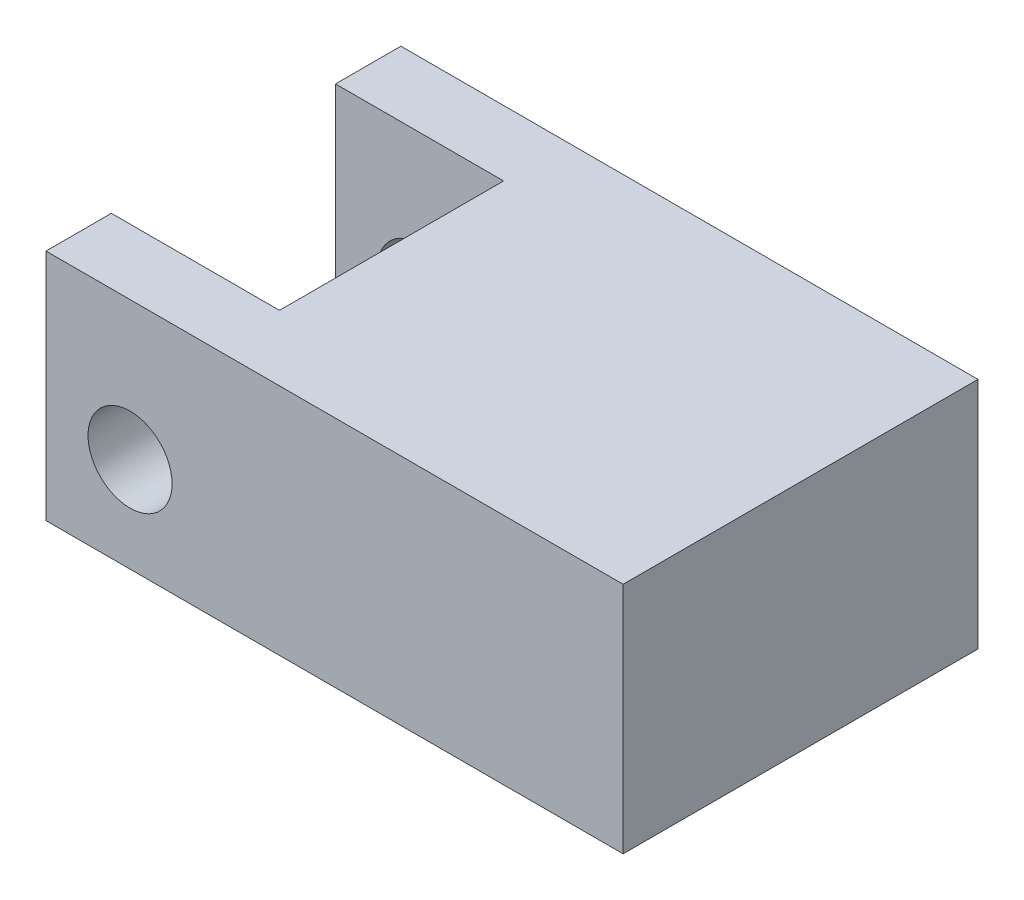
ISO-10303-21;
HEADER;
FILE_DESCRIPTION(('STEP AP214'),'2;1');
FILE_NAME('part.step','',(''),(''),'','','');
FILE_SCHEMA(('AUTOMOTIVE_DESIGN { 1 0 10303 214 1 1 1 1 }'));
ENDSEC;
DATA;
#1=APPLICATION_CONTEXT('core data for automotive mechanical design processes');
#2=APPLICATION_PROTOCOL_DEFINITION('international standard','automotive_design',2000,#1);
#3=PRODUCT_CONTEXT('',#1,'mechanical');
#4=PRODUCT('Part','Part','',(#3));
#5=PRODUCT_RELATED_PRODUCT_CATEGORY('part','',(#4));
#6=PRODUCT_DEFINITION_FORMATION('','',#4);
#7=PRODUCT_DEFINITION_CONTEXT('part definition',#1,'design');
#8=PRODUCT_DEFINITION('design','',#6,#7);
#9=PRODUCT_DEFINITION_SHAPE('','',#8);
#10=(LENGTH_UNIT() NAMED_UNIT(*) SI_UNIT(.MILLI.,.METRE.));
#11=(NAMED_UNIT(*) PLANE_ANGLE_UNIT() SI_UNIT($,.RADIAN.));
#12=(NAMED_UNIT(*) SI_UNIT($,.STERADIAN.) SOLID_ANGLE_UNIT());
#13=UNCERTAINTY_MEASURE_WITH_UNIT(LENGTH_MEASURE(1.E-05),#10,'distance_accuracy_value','');
#14=(GEOMETRIC_REPRESENTATION_CONTEXT(3) GLOBAL_UNCERTAINTY_ASSIGNED_CONTEXT((#13)) GLOBAL_UNIT_ASSIGNED_CONTEXT((#10,
#11,#12)) REPRESENTATION_CONTEXT('',''));
#15=CARTESIAN_POINT('',(0.,0.,0.));
#16=DIRECTION('',(0.,0.,1.));
#17=DIRECTION('',(1.,0.,0.));
#18=AXIS2_PLACEMENT_3D('',#15,#16,#17);
#19=CARTESIAN_POINT('',(-15.45,6.25,9.499999986));
#20=DIRECTION('',(1.,0.,0.));
#21=DIRECTION('',(0.,1.,0.));
#22=AXIS2_PLACEMENT_3D('',#19,#20,#21);
#23=PLANE('',#22);
#24=DIRECTION('',(0.,0.,-1.));
#25=VECTOR('',#24,1.);
#26=CARTESIAN_POINT('',(-15.45,-6.25,9.499999986));
#27=LINE('',#26,#25);
#28=CARTESIAN_POINT('',(-15.45,-6.25,-6.));
#29=VERTEX_POINT('',#28);
#30=CARTESIAN_POINT('',(-15.45,-6.25,-9.499999986));
#31=VERTEX_POINT('',#30);
#32=EDGE_CURVE('E137',#29,#31,#27,.T.);
#33=ORIENTED_EDGE('',*,*,#32,.F.);
#34=DIRECTION('',(0.,1.,0.));
#35=VECTOR('',#34,1.);
#36=CARTESIAN_POINT('',(-15.45,-21.25,-6.));
#37=LINE('',#36,#35);
#38=CARTESIAN_POINT('',(-15.45,6.25,-6.));
#39=VERTEX_POINT('',#38);
#40=EDGE_CURVE('E160',#29,#39,#37,.T.);
#41=ORIENTED_EDGE('',*,*,#40,.T.);
#42=DIRECTION('',(0.,0.,-1.));
#43=VECTOR('',#42,1.);
#44=CARTESIAN_POINT('',(-15.45,6.25,9.499999986));
#45=LINE('',#44,#43);
#46=CARTESIAN_POINT('',(-15.45,6.25,-9.499999986));
#47=VERTEX_POINT('',#46);
#48=EDGE_CURVE('E132',#39,#47,#45,.T.);
#49=ORIENTED_EDGE('',*,*,#48,.T.);
#50=DIRECTION('',(0.,-1.,0.));
#51=VECTOR('',#50,1.);
#52=CARTESIAN_POINT('',(-15.45,6.25,-9.499999986));
#53=LINE('',#52,#51);
#54=EDGE_CURVE('E142',#47,#31,#53,.T.);
#55=ORIENTED_EDGE('',*,*,#54,.T.);
#56=EDGE_LOOP('',(#33,#41,#49,#55));
#57=FACE_BOUND('',#56,.T.);
#58=ADVANCED_FACE('F37',(#57),#23,.F.);
#59=CARTESIAN_POINT('',(15.45,6.25,9.499999986));
#60=DIRECTION('',(-1.,0.,0.));
#61=DIRECTION('',(0.,-1.,0.));
#62=AXIS2_PLACEMENT_3D('',#59,#60,#61);
#63=PLANE('',#62);
#64=DIRECTION('',(0.,1.,0.));
#65=VECTOR('',#64,1.);
#66=CARTESIAN_POINT('',(15.45,6.25,-9.499999986));
#67=LINE('',#66,#65);
#68=CARTESIAN_POINT('',(15.45,-6.25,-9.499999986));
#69=VERTEX_POINT('',#68);
#70=CARTESIAN_POINT('',(15.45,6.25,-9.499999986));
#71=VERTEX_POINT('',#70);
#72=EDGE_CURVE('E148',#69,#71,#67,.T.);
#73=ORIENTED_EDGE('',*,*,#72,.T.);
#74=DIRECTION('',(0.,0.,-1.));
#75=VECTOR('',#74,1.);
#76=CARTESIAN_POINT('',(15.45,6.25,9.499999986));
#77=LINE('',#76,#75);
#78=CARTESIAN_POINT('',(15.45,6.25,9.499999986));
#79=VERTEX_POINT('',#78);
#80=EDGE_CURVE('E11',#79,#71,#77,.T.);
#81=ORIENTED_EDGE('',*,*,#80,.F.);
#82=DIRECTION('',(0.,1.,0.));
#83=VECTOR('',#82,1.);
#84=CARTESIAN_POINT('',(15.45,6.25,9.499999986));
#85=LINE('',#84,#83);
#86=CARTESIAN_POINT('',(15.45,-6.25,9.499999986));
#87=VERTEX_POINT('',#86);
#88=EDGE_CURVE('E141',#87,#79,#85,.T.);
#89=ORIENTED_EDGE('',*,*,#88,.F.);
#90=DIRECTION('',(0.,0.,-1.));
#91=VECTOR('',#90,1.);
#92=CARTESIAN_POINT('',(15.45,-6.25,9.499999986));
#93=LINE('',#92,#91);
#94=EDGE_CURVE('E138',#87,#69,#93,.T.);
#95=ORIENTED_EDGE('',*,*,#94,.T.);
#96=EDGE_LOOP('',(#73,#81,#89,#95));
#97=FACE_BOUND('',#96,.T.);
#98=ADVANCED_FACE('F39',(#97),#63,.F.);
#99=CARTESIAN_POINT('',(-15.45,6.25,9.499999986));
#100=DIRECTION('',(0.,-1.,0.));
#101=DIRECTION('',(0.,0.,-1.));
#102=AXIS2_PLACEMENT_3D('',#99,#100,#101);
#103=PLANE('',#102);
#104=ORIENTED_EDGE('',*,*,#48,.F.);
#105=DIRECTION('',(-1.,0.,0.));
#106=VECTOR('',#105,1.);
#107=CARTESIAN_POINT('',(-15.45,6.25,-6.));
#108=LINE('',#107,#106);
#109=CARTESIAN_POINT('',(-6.45,6.25,-6.));
#110=VERTEX_POINT('',#109);
#111=EDGE_CURVE('E120',#110,#39,#108,.T.);
#112=ORIENTED_EDGE('',*,*,#111,.F.);
#113=DIRECTION('',(0.,0.,-1.));
#114=VECTOR('',#113,1.);
#115=CARTESIAN_POINT('',(-6.45,6.25,-6.));
#116=LINE('',#115,#114);
#117=CARTESIAN_POINT('',(-6.45,6.25,6.));
#118=VERTEX_POINT('',#117);
#119=EDGE_CURVE('E127',#118,#110,#116,.T.);
#120=ORIENTED_EDGE('',*,*,#119,.F.);
#121=DIRECTION('',(1.,0.,0.));
#122=VECTOR('',#121,1.);
#123=CARTESIAN_POINT('',(-6.45,6.25,6.));
#124=LINE('',#123,#122);
#125=CARTESIAN_POINT('',(-15.45,6.25,6.));
#126=VERTEX_POINT('',#125);
#127=EDGE_CURVE('E112',#126,#118,#124,.T.);
#128=ORIENTED_EDGE('',*,*,#127,.F.);
#129=CARTESIAN_POINT('',(-15.45,6.25,9.499999986));
#130=VERTEX_POINT('',#129);
#131=EDGE_CURVE('E46',#130,#126,#45,.T.);
#132=ORIENTED_EDGE('',*,*,#131,.F.);
#133=DIRECTION('',(-1.,0.,0.));
#134=VECTOR('',#133,1.);
#135=CARTESIAN_POINT('',(-15.45,6.25,9.499999986));
#136=LINE('',#135,#134);
#137=EDGE_CURVE('E89',#79,#130,#136,.T.);
#138=ORIENTED_EDGE('',*,*,#137,.F.);
#139=ORIENTED_EDGE('',*,*,#80,.T.);
#140=DIRECTION('',(-1.,0.,0.));
#141=VECTOR('',#140,1.);
#142=CARTESIAN_POINT('',(-15.45,6.25,-9.499999986));
#143=LINE('',#142,#141);
#144=EDGE_CURVE('E145',#71,#47,#143,.T.);
#145=ORIENTED_EDGE('',*,*,#144,.T.);
#146=EDGE_LOOP('',(#104,#112,#120,#128,#132,#138,#139,#145));
#147=FACE_BOUND('',#146,.T.);
#148=ADVANCED_FACE('F123',(#147),#103,.F.);
#149=ORIENTED_EDGE('',*,*,#131,.T.);
#150=DIRECTION('',(0.,1.,0.));
#151=VECTOR('',#150,1.);
#152=CARTESIAN_POINT('',(-15.45,-21.25,6.));
#153=LINE('',#152,#151);
#154=CARTESIAN_POINT('',(-15.45,-6.25,6.));
#155=VERTEX_POINT('',#154);
#156=EDGE_CURVE('E109',#155,#126,#153,.T.);
#157=ORIENTED_EDGE('',*,*,#156,.F.);
#158=CARTESIAN_POINT('',(-15.45,-6.25,9.499999986));
#159=VERTEX_POINT('',#158);
#160=EDGE_CURVE('E134',#159,#155,#27,.T.);
#161=ORIENTED_EDGE('',*,*,#160,.F.);
#162=DIRECTION('',(0.,-1.,0.));
#163=VECTOR('',#162,1.);
#164=CARTESIAN_POINT('',(-15.45,6.25,9.499999986));
#165=LINE('',#164,#163);
#166=EDGE_CURVE('E131',#130,#159,#165,.T.);
#167=ORIENTED_EDGE('',*,*,#166,.F.);
#168=EDGE_LOOP('',(#149,#157,#161,#167));
#169=FACE_BOUND('',#168,.T.);
#170=ADVANCED_FACE('F130',(#169),#23,.F.);
#171=CARTESIAN_POINT('',(-15.45,-6.25,9.499999986));
#172=DIRECTION('',(0.,1.,0.));
#173=DIRECTION('',(0.,0.,1.));
#174=AXIS2_PLACEMENT_3D('',#171,#172,#173);
#175=PLANE('',#174);
#176=DIRECTION('',(0.,0.,1.));
#177=VECTOR('',#176,1.);
#178=CARTESIAN_POINT('',(-6.45,-6.25,-6.));
#179=LINE('',#178,#177);
#180=CARTESIAN_POINT('',(-6.45,-6.25,-6.));
#181=VERTEX_POINT('',#180);
#182=CARTESIAN_POINT('',(-6.45,-6.25,6.));
#183=VERTEX_POINT('',#182);
#184=EDGE_CURVE('E163',#181,#183,#179,.T.);
#185=ORIENTED_EDGE('',*,*,#184,.F.);
#186=DIRECTION('',(1.,0.,0.));
#187=VECTOR('',#186,1.);
#188=CARTESIAN_POINT('',(-15.45,-6.25,-6.));
#189=LINE('',#188,#187);
#190=EDGE_CURVE('E155',#29,#181,#189,.T.);
#191=ORIENTED_EDGE('',*,*,#190,.F.);
#192=ORIENTED_EDGE('',*,*,#32,.T.);
#193=DIRECTION('',(1.,0.,0.));
#194=VECTOR('',#193,1.);
#195=CARTESIAN_POINT('',(-15.45,-6.25,-9.499999986));
#196=LINE('',#195,#194);
#197=EDGE_CURVE('E82',#31,#69,#196,.T.);
#198=ORIENTED_EDGE('',*,*,#197,.T.);
#199=ORIENTED_EDGE('',*,*,#94,.F.);
#200=DIRECTION('',(1.,0.,0.));
#201=VECTOR('',#200,1.);
#202=CARTESIAN_POINT('',(-15.45,-6.25,9.499999986));
#203=LINE('',#202,#201);
#204=EDGE_CURVE('E62',#159,#87,#203,.T.);
#205=ORIENTED_EDGE('',*,*,#204,.F.);
#206=ORIENTED_EDGE('',*,*,#160,.T.);
#207=DIRECTION('',(-1.,0.,0.));
#208=VECTOR('',#207,1.);
#209=CARTESIAN_POINT('',(-6.45,-6.25,6.));
#210=LINE('',#209,#208);
#211=EDGE_CURVE('E115',#183,#155,#210,.T.);
#212=ORIENTED_EDGE('',*,*,#211,.F.);
#213=EDGE_LOOP('',(#185,#191,#192,#198,#199,#205,#206,#212));
#214=FACE_BOUND('',#213,.T.);
#215=ADVANCED_FACE('F183',(#214),#175,.F.);
#216=CARTESIAN_POINT('',(0.,0.,9.499999986));
#217=DIRECTION('',(0.,0.,1.));
#218=DIRECTION('',(1.,0.,0.));
#219=AXIS2_PLACEMENT_3D('',#216,#217,#218);
#220=PLANE('',#219);
#221=CARTESIAN_POINT('',(-10.95,-1.17,9.499999986));
#222=DIRECTION('',(0.,0.,1.));
#223=DIRECTION('',(1.,0.,0.));
#224=AXIS2_PLACEMENT_3D('',#221,#222,#223);
#225=CIRCLE('',#224,2.25);
#226=CARTESIAN_POINT('',(-8.7,-1.17,9.499999986));
#227=VERTEX_POINT('',#226);
#228=EDGE_CURVE('E173',#227,#227,#225,.T.);
#229=ORIENTED_EDGE('',*,*,#228,.F.);
#230=EDGE_LOOP('',(#229));
#231=FACE_BOUND('',#230,.T.);
#232=ORIENTED_EDGE('',*,*,#88,.T.);
#233=ORIENTED_EDGE('',*,*,#137,.T.);
#234=ORIENTED_EDGE('',*,*,#166,.T.);
#235=ORIENTED_EDGE('',*,*,#204,.T.);
#236=EDGE_LOOP('',(#232,#233,#234,#235));
#237=FACE_BOUND('',#236,.T.);
#238=ADVANCED_FACE('F180',(#231,#237),#220,.T.);
#239=CARTESIAN_POINT('',(0.,0.,-9.499999986));
#240=DIRECTION('',(0.,0.,1.));
#241=DIRECTION('',(1.,0.,0.));
#242=AXIS2_PLACEMENT_3D('',#239,#240,#241);
#243=PLANE('',#242);
#244=CARTESIAN_POINT('',(-10.95,-1.17,-9.499999986));
#245=DIRECTION('',(0.,0.,1.));
#246=DIRECTION('',(1.,0.,0.));
#247=AXIS2_PLACEMENT_3D('',#244,#245,#246);
#248=CIRCLE('',#247,2.25);
#249=CARTESIAN_POINT('',(-8.7,-1.17,-9.499999986));
#250=VERTEX_POINT('',#249);
#251=EDGE_CURVE('E170',#250,#250,#248,.F.);
#252=ORIENTED_EDGE('',*,*,#251,.F.);
#253=EDGE_LOOP('',(#252));
#254=FACE_BOUND('',#253,.T.);
#255=ORIENTED_EDGE('',*,*,#72,.F.);
#256=ORIENTED_EDGE('',*,*,#197,.F.);
#257=ORIENTED_EDGE('',*,*,#54,.F.);
#258=ORIENTED_EDGE('',*,*,#144,.F.);
#259=EDGE_LOOP('',(#255,#256,#257,#258));
#260=FACE_BOUND('',#259,.T.);
#261=ADVANCED_FACE('F182',(#254,#260),#243,.F.);
#262=CARTESIAN_POINT('',(-15.45,-21.25,-6.));
#263=DIRECTION('',(0.,0.,-1.));
#264=DIRECTION('',(-1.,0.,0.));
#265=AXIS2_PLACEMENT_3D('',#262,#263,#264);
#266=PLANE('',#265);
#267=CARTESIAN_POINT('',(-10.95,-1.17,-6.));
#268=DIRECTION('',(0.,0.,-1.));
#269=DIRECTION('',(-1.,0.,0.));
#270=AXIS2_PLACEMENT_3D('',#267,#268,#269);
#271=CIRCLE('',#270,2.25);
#272=CARTESIAN_POINT('',(-13.2,-1.17,-6.));
#273=VERTEX_POINT('',#272);
#274=EDGE_CURVE('E128',#273,#273,#271,.T.);
#275=ORIENTED_EDGE('',*,*,#274,.T.);
#276=EDGE_LOOP('',(#275));
#277=FACE_BOUND('',#276,.T.);
#278=ORIENTED_EDGE('',*,*,#190,.T.);
#279=DIRECTION('',(0.,1.,0.));
#280=VECTOR('',#279,1.);
#281=CARTESIAN_POINT('',(-6.45,-21.25,-6.));
#282=LINE('',#281,#280);
#283=EDGE_CURVE('E158',#181,#110,#282,.T.);
#284=ORIENTED_EDGE('',*,*,#283,.T.);
#285=ORIENTED_EDGE('',*,*,#111,.T.);
#286=ORIENTED_EDGE('',*,*,#40,.F.);
#287=EDGE_LOOP('',(#278,#284,#285,#286));
#288=FACE_BOUND('',#287,.T.);
#289=ADVANCED_FACE('F195',(#277,#288),#266,.F.);
#290=CARTESIAN_POINT('',(-6.45,-21.25,-6.));
#291=DIRECTION('',(1.,0.,0.));
#292=DIRECTION('',(0.,0.,-1.));
#293=AXIS2_PLACEMENT_3D('',#290,#291,#292);
#294=PLANE('',#293);
#295=ORIENTED_EDGE('',*,*,#184,.T.);
#296=DIRECTION('',(0.,1.,0.));
#297=VECTOR('',#296,1.);
#298=CARTESIAN_POINT('',(-6.45,-21.25,6.));
#299=LINE('',#298,#297);
#300=EDGE_CURVE('E53',#183,#118,#299,.T.);
#301=ORIENTED_EDGE('',*,*,#300,.T.);
#302=ORIENTED_EDGE('',*,*,#119,.T.);
#303=ORIENTED_EDGE('',*,*,#283,.F.);
#304=EDGE_LOOP('',(#295,#301,#302,#303));
#305=FACE_BOUND('',#304,.T.);
#306=ADVANCED_FACE('F199',(#305),#294,.F.);
#307=CARTESIAN_POINT('',(-6.45,-21.25,6.));
#308=DIRECTION('',(0.,0.,1.));
#309=DIRECTION('',(1.,0.,0.));
#310=AXIS2_PLACEMENT_3D('',#307,#308,#309);
#311=PLANE('',#310);
#312=CARTESIAN_POINT('',(-10.95,-1.17,6.));
#313=DIRECTION('',(0.,0.,1.));
#314=DIRECTION('',(1.,0.,0.));
#315=AXIS2_PLACEMENT_3D('',#312,#313,#314);
#316=CIRCLE('',#315,2.25);
#317=CARTESIAN_POINT('',(-8.7,-1.17,6.));
#318=VERTEX_POINT('',#317);
#319=EDGE_CURVE('E41',#318,#318,#316,.T.);
#320=ORIENTED_EDGE('',*,*,#319,.T.);
#321=EDGE_LOOP('',(#320));
#322=FACE_BOUND('',#321,.T.);
#323=ORIENTED_EDGE('',*,*,#211,.T.);
#324=ORIENTED_EDGE('',*,*,#156,.T.);
#325=ORIENTED_EDGE('',*,*,#127,.T.);
#326=ORIENTED_EDGE('',*,*,#300,.F.);
#327=EDGE_LOOP('',(#323,#324,#325,#326));
#328=FACE_BOUND('',#327,.T.);
#329=ADVANCED_FACE('F111',(#322,#328),#311,.F.);
#330=CARTESIAN_POINT('',(-10.95,-1.17,-15.8639610166789));
#331=DIRECTION('',(0.,0.,1.));
#332=DIRECTION('',(1.,0.,0.));
#333=AXIS2_PLACEMENT_3D('',#330,#331,#332);
#334=CYLINDRICAL_SURFACE('',#333,2.25);
#335=ORIENTED_EDGE('',*,*,#228,.T.);
#336=EDGE_LOOP('',(#335));
#337=FACE_BOUND('',#336,.T.);
#338=ORIENTED_EDGE('',*,*,#319,.F.);
#339=EDGE_LOOP('',(#338));
#340=FACE_BOUND('',#339,.T.);
#341=ADVANCED_FACE('F177',(#337,#340),#334,.F.);
#342=ORIENTED_EDGE('',*,*,#251,.T.);
#343=EDGE_LOOP('',(#342));
#344=FACE_BOUND('',#343,.T.);
#345=ORIENTED_EDGE('',*,*,#274,.F.);
#346=EDGE_LOOP('',(#345));
#347=FACE_BOUND('',#346,.T.);
#348=ADVANCED_FACE('F264',(#344,#347),#334,.F.);
#349=CLOSED_SHELL('',(#58,#98,#148,#170,#215,#238,#261,#289,#306,#329,#341,#348));
#350=MANIFOLD_SOLID_BREP('B2',#349);
#351=ADVANCED_BREP_SHAPE_REPRESENTATION('',(#18,#350),#14);
#352=SHAPE_DEFINITION_REPRESENTATION(#9,#351);
ENDSEC;
END-ISO-10303-21;
